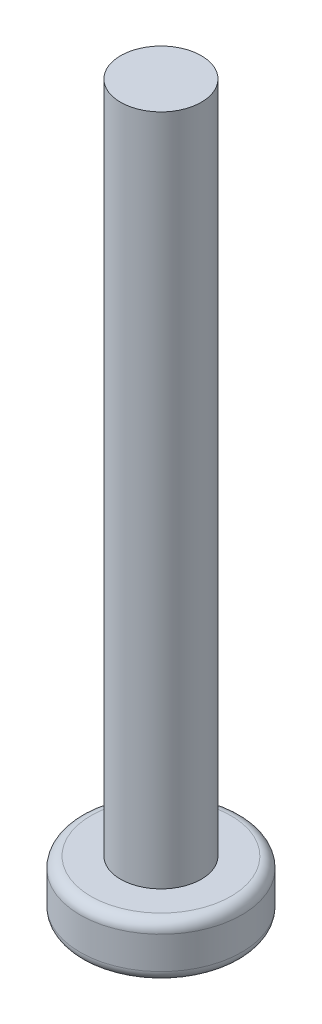
ISO-10303-21;
HEADER;
FILE_DESCRIPTION(('STEP AP214'),'2;1');
FILE_NAME('part.step','',(''),(''),'','','');
FILE_SCHEMA(('AUTOMOTIVE_DESIGN { 1 0 10303 214 1 1 1 1 }'));
ENDSEC;
DATA;
#1=APPLICATION_CONTEXT('core data for automotive mechanical design processes');
#2=APPLICATION_PROTOCOL_DEFINITION('international standard','automotive_design',2000,#1);
#3=PRODUCT_CONTEXT('',#1,'mechanical');
#4=PRODUCT('Part','Part','',(#3));
#5=PRODUCT_RELATED_PRODUCT_CATEGORY('part','',(#4));
#6=PRODUCT_DEFINITION_FORMATION('','',#4);
#7=PRODUCT_DEFINITION_CONTEXT('part definition',#1,'design');
#8=PRODUCT_DEFINITION('design','',#6,#7);
#9=PRODUCT_DEFINITION_SHAPE('','',#8);
#10=(LENGTH_UNIT() NAMED_UNIT(*) SI_UNIT(.MILLI.,.METRE.));
#11=(NAMED_UNIT(*) PLANE_ANGLE_UNIT() SI_UNIT($,.RADIAN.));
#12=(NAMED_UNIT(*) SI_UNIT($,.STERADIAN.) SOLID_ANGLE_UNIT());
#13=UNCERTAINTY_MEASURE_WITH_UNIT(LENGTH_MEASURE(1.E-05),#10,'distance_accuracy_value','');
#14=(GEOMETRIC_REPRESENTATION_CONTEXT(3) GLOBAL_UNCERTAINTY_ASSIGNED_CONTEXT((#13)) GLOBAL_UNIT_ASSIGNED_CONTEXT((#10,
#11,#12)) REPRESENTATION_CONTEXT('',''));
#15=CARTESIAN_POINT('',(0.,0.,0.));
#16=DIRECTION('',(0.,0.,1.));
#17=DIRECTION('',(1.,0.,0.));
#18=AXIS2_PLACEMENT_3D('',#15,#16,#17);
#19=CARTESIAN_POINT('',(0.,2.,0.));
#20=DIRECTION('',(0.,1.,0.));
#21=DIRECTION('',(0.,0.,1.));
#22=AXIS2_PLACEMENT_3D('',#19,#20,#21);
#23=PLANE('',#22);
#24=CARTESIAN_POINT('',(0.,2.,0.));
#25=DIRECTION('',(0.,1.,0.));
#26=DIRECTION('',(0.,0.,1.));
#27=AXIS2_PLACEMENT_3D('',#24,#25,#26);
#28=CIRCLE('',#27,2.6);
#29=CARTESIAN_POINT('',(0.,2.,2.6));
#30=VERTEX_POINT('',#29);
#31=EDGE_CURVE('E215',#30,#30,#28,.T.);
#32=ORIENTED_EDGE('',*,*,#31,.T.);
#33=EDGE_LOOP('',(#32));
#34=FACE_BOUND('',#33,.T.);
#35=CARTESIAN_POINT('',(0.,2.,0.));
#36=DIRECTION('',(0.,1.,0.));
#37=DIRECTION('',(0.,0.,1.));
#38=AXIS2_PLACEMENT_3D('',#35,#36,#37);
#39=CIRCLE('',#38,1.5);
#40=CARTESIAN_POINT('',(0.,2.,1.5));
#41=VERTEX_POINT('',#40);
#42=EDGE_CURVE('E194',#41,#41,#39,.T.);
#43=ORIENTED_EDGE('',*,*,#42,.F.);
#44=EDGE_LOOP('',(#43));
#45=FACE_BOUND('',#44,.T.);
#46=ADVANCED_FACE('F35',(#34,#45),#23,.T.);
#47=CARTESIAN_POINT('',(0.,2.,0.));
#48=DIRECTION('',(0.,-1.,0.));
#49=DIRECTION('',(0.,0.,-1.));
#50=AXIS2_PLACEMENT_3D('',#47,#48,#49);
#51=CYLINDRICAL_SURFACE('',#50,3.);
#52=CARTESIAN_POINT('',(0.,1.6,0.));
#53=DIRECTION('',(0.,1.,0.));
#54=DIRECTION('',(0.,0.,1.));
#55=AXIS2_PLACEMENT_3D('',#52,#53,#54);
#56=CIRCLE('',#55,3.);
#57=CARTESIAN_POINT('',(0.,1.6,3.));
#58=VERTEX_POINT('',#57);
#59=EDGE_CURVE('E43',#58,#58,#56,.F.);
#60=ORIENTED_EDGE('',*,*,#59,.T.);
#61=EDGE_LOOP('',(#60));
#62=FACE_BOUND('',#61,.T.);
#63=CARTESIAN_POINT('',(0.,0.4,0.));
#64=DIRECTION('',(0.,1.,0.));
#65=DIRECTION('',(0.,0.,1.));
#66=AXIS2_PLACEMENT_3D('',#63,#64,#65);
#67=CIRCLE('',#66,3.);
#68=CARTESIAN_POINT('',(0.,0.4,3.));
#69=VERTEX_POINT('',#68);
#70=EDGE_CURVE('E220',#69,#69,#67,.T.);
#71=ORIENTED_EDGE('',*,*,#70,.T.);
#72=EDGE_LOOP('',(#71));
#73=FACE_BOUND('',#72,.T.);
#74=ADVANCED_FACE('F225',(#62,#73),#51,.T.);
#75=CARTESIAN_POINT('',(0.,0.,0.));
#76=DIRECTION('',(0.,1.,0.));
#77=DIRECTION('',(0.,0.,1.));
#78=AXIS2_PLACEMENT_3D('',#75,#76,#77);
#79=PLANE('',#78);
#80=CARTESIAN_POINT('',(0.,0.,0.));
#81=DIRECTION('',(0.,1.,0.));
#82=DIRECTION('',(0.,0.,1.));
#83=AXIS2_PLACEMENT_3D('',#80,#81,#82);
#84=CIRCLE('',#83,2.6);
#85=CARTESIAN_POINT('',(0.,0.,2.6));
#86=VERTEX_POINT('',#85);
#87=EDGE_CURVE('E11',#86,#86,#84,.F.);
#88=ORIENTED_EDGE('',*,*,#87,.T.);
#89=EDGE_LOOP('',(#88));
#90=FACE_BOUND('',#89,.T.);
#91=DIRECTION('',(1.,0.,0.));
#92=VECTOR('',#91,1.);
#93=CARTESIAN_POINT('',(0.,0.,0.45));
#94=LINE('',#93,#92);
#95=CARTESIAN_POINT('',(-1.5,0.,0.45));
#96=VERTEX_POINT('',#95);
#97=CARTESIAN_POINT('',(-0.45,0.,0.45));
#98=VERTEX_POINT('',#97);
#99=EDGE_CURVE('E162',#96,#98,#94,.T.);
#100=ORIENTED_EDGE('',*,*,#99,.T.);
#101=DIRECTION('',(0.,0.,-1.));
#102=VECTOR('',#101,1.);
#103=CARTESIAN_POINT('',(-0.45,0.,0.));
#104=LINE('',#103,#102);
#105=CARTESIAN_POINT('',(-0.45,0.,1.5));
#106=VERTEX_POINT('',#105);
#107=EDGE_CURVE('E50',#106,#98,#104,.T.);
#108=ORIENTED_EDGE('',*,*,#107,.F.);
#109=DIRECTION('',(1.,0.,0.));
#110=VECTOR('',#109,1.);
#111=CARTESIAN_POINT('',(0.,0.,1.5));
#112=LINE('',#111,#110);
#113=CARTESIAN_POINT('',(0.45,0.,1.5));
#114=VERTEX_POINT('',#113);
#115=EDGE_CURVE('E189',#106,#114,#112,.T.);
#116=ORIENTED_EDGE('',*,*,#115,.T.);
#117=DIRECTION('',(0.,0.,-1.));
#118=VECTOR('',#117,1.);
#119=CARTESIAN_POINT('',(0.45,0.,0.));
#120=LINE('',#119,#118);
#121=CARTESIAN_POINT('',(0.45,0.,0.45));
#122=VERTEX_POINT('',#121);
#123=EDGE_CURVE('E187',#114,#122,#120,.T.);
#124=ORIENTED_EDGE('',*,*,#123,.T.);
#125=DIRECTION('',(1.,0.,0.));
#126=VECTOR('',#125,1.);
#127=CARTESIAN_POINT('',(0.,0.,0.45));
#128=LINE('',#127,#126);
#129=CARTESIAN_POINT('',(1.5,0.,0.45));
#130=VERTEX_POINT('',#129);
#131=EDGE_CURVE('E145',#122,#130,#128,.T.);
#132=ORIENTED_EDGE('',*,*,#131,.T.);
#133=DIRECTION('',(0.,0.,-1.));
#134=VECTOR('',#133,1.);
#135=CARTESIAN_POINT('',(1.5,0.,0.));
#136=LINE('',#135,#134);
#137=CARTESIAN_POINT('',(1.5,0.,-0.45));
#138=VERTEX_POINT('',#137);
#139=EDGE_CURVE('E183',#130,#138,#136,.T.);
#140=ORIENTED_EDGE('',*,*,#139,.T.);
#141=DIRECTION('',(1.,0.,0.));
#142=VECTOR('',#141,1.);
#143=CARTESIAN_POINT('',(0.,0.,-0.45));
#144=LINE('',#143,#142);
#145=CARTESIAN_POINT('',(0.45,0.,-0.45));
#146=VERTEX_POINT('',#145);
#147=EDGE_CURVE('E180',#146,#138,#144,.T.);
#148=ORIENTED_EDGE('',*,*,#147,.F.);
#149=DIRECTION('',(0.,0.,-1.));
#150=VECTOR('',#149,1.);
#151=CARTESIAN_POINT('',(0.45,0.,0.));
#152=LINE('',#151,#150);
#153=CARTESIAN_POINT('',(0.45,0.,-1.5));
#154=VERTEX_POINT('',#153);
#155=EDGE_CURVE('E177',#146,#154,#152,.T.);
#156=ORIENTED_EDGE('',*,*,#155,.T.);
#157=DIRECTION('',(1.,0.,0.));
#158=VECTOR('',#157,1.);
#159=CARTESIAN_POINT('',(0.,0.,-1.5));
#160=LINE('',#159,#158);
#161=CARTESIAN_POINT('',(-0.45,0.,-1.5));
#162=VERTEX_POINT('',#161);
#163=EDGE_CURVE('E174',#162,#154,#160,.T.);
#164=ORIENTED_EDGE('',*,*,#163,.F.);
#165=DIRECTION('',(0.,0.,-1.));
#166=VECTOR('',#165,1.);
#167=CARTESIAN_POINT('',(-0.45,0.,0.));
#168=LINE('',#167,#166);
#169=CARTESIAN_POINT('',(-0.45,0.,-0.45));
#170=VERTEX_POINT('',#169);
#171=EDGE_CURVE('E171',#170,#162,#168,.T.);
#172=ORIENTED_EDGE('',*,*,#171,.F.);
#173=DIRECTION('',(1.,0.,0.));
#174=VECTOR('',#173,1.);
#175=CARTESIAN_POINT('',(0.,0.,-0.45));
#176=LINE('',#175,#174);
#177=CARTESIAN_POINT('',(-1.5,0.,-0.45));
#178=VERTEX_POINT('',#177);
#179=EDGE_CURVE('E168',#178,#170,#176,.T.);
#180=ORIENTED_EDGE('',*,*,#179,.F.);
#181=DIRECTION('',(0.,0.,-1.));
#182=VECTOR('',#181,1.);
#183=CARTESIAN_POINT('',(-1.5,0.,0.));
#184=LINE('',#183,#182);
#185=EDGE_CURVE('E165',#96,#178,#184,.T.);
#186=ORIENTED_EDGE('',*,*,#185,.F.);
#187=EDGE_LOOP('',(#100,#108,#116,#124,#132,#140,#148,#156,#164,#172,#180,#186));
#188=FACE_BOUND('',#187,.T.);
#189=ADVANCED_FACE('F241',(#90,#188),#79,.F.);
#190=CARTESIAN_POINT('',(0.,27.,0.));
#191=DIRECTION('',(0.,-1.,0.));
#192=DIRECTION('',(0.,0.,-1.));
#193=AXIS2_PLACEMENT_3D('',#190,#191,#192);
#194=CYLINDRICAL_SURFACE('',#193,1.5);
#195=CARTESIAN_POINT('',(0.,27.,0.));
#196=DIRECTION('',(0.,1.,0.));
#197=DIRECTION('',(0.,0.,1.));
#198=AXIS2_PLACEMENT_3D('',#195,#196,#197);
#199=CIRCLE('',#198,1.5);
#200=CARTESIAN_POINT('',(0.,27.,1.5));
#201=VERTEX_POINT('',#200);
#202=EDGE_CURVE('E212',#201,#201,#199,.T.);
#203=ORIENTED_EDGE('',*,*,#202,.F.);
#204=EDGE_LOOP('',(#203));
#205=FACE_BOUND('',#204,.T.);
#206=ORIENTED_EDGE('',*,*,#42,.T.);
#207=EDGE_LOOP('',(#206));
#208=FACE_BOUND('',#207,.T.);
#209=ADVANCED_FACE('F238',(#205,#208),#194,.T.);
#210=CARTESIAN_POINT('',(0.,27.,0.));
#211=DIRECTION('',(0.,1.,0.));
#212=DIRECTION('',(0.,0.,1.));
#213=AXIS2_PLACEMENT_3D('',#210,#211,#212);
#214=PLANE('',#213);
#215=ORIENTED_EDGE('',*,*,#202,.T.);
#216=EDGE_LOOP('',(#215));
#217=FACE_BOUND('',#216,.T.);
#218=ADVANCED_FACE('F240',(#217),#214,.T.);
#219=CARTESIAN_POINT('',(-0.45,1.9,0.));
#220=DIRECTION('',(-1.,0.,0.));
#221=DIRECTION('',(0.,0.,1.));
#222=AXIS2_PLACEMENT_3D('',#219,#220,#221);
#223=PLANE('',#222);
#224=ORIENTED_EDGE('',*,*,#107,.T.);
#225=DIRECTION('',(0.,-1.,0.));
#226=VECTOR('',#225,1.);
#227=CARTESIAN_POINT('',(-0.45,1.9,0.45));
#228=LINE('',#227,#226);
#229=CARTESIAN_POINT('',(-0.45,1.9,0.45));
#230=VERTEX_POINT('',#229);
#231=EDGE_CURVE('E160',#230,#98,#228,.T.);
#232=ORIENTED_EDGE('',*,*,#231,.F.);
#233=DIRECTION('',(0.,0.,-1.));
#234=VECTOR('',#233,1.);
#235=CARTESIAN_POINT('',(-0.45,1.9,0.));
#236=LINE('',#235,#234);
#237=CARTESIAN_POINT('',(-0.45,1.9,1.5));
#238=VERTEX_POINT('',#237);
#239=EDGE_CURVE('E192',#238,#230,#236,.T.);
#240=ORIENTED_EDGE('',*,*,#239,.F.);
#241=DIRECTION('',(0.,-1.,0.));
#242=VECTOR('',#241,1.);
#243=CARTESIAN_POINT('',(-0.45,1.9,1.5));
#244=LINE('',#243,#242);
#245=EDGE_CURVE('E58',#238,#106,#244,.T.);
#246=ORIENTED_EDGE('',*,*,#245,.T.);
#247=EDGE_LOOP('',(#224,#232,#240,#246));
#248=FACE_BOUND('',#247,.T.);
#249=ADVANCED_FACE('F248',(#248),#223,.F.);
#250=CARTESIAN_POINT('',(0.,1.9,1.5));
#251=DIRECTION('',(0.,0.,-1.));
#252=DIRECTION('',(-1.,0.,0.));
#253=AXIS2_PLACEMENT_3D('',#250,#251,#252);
#254=PLANE('',#253);
#255=ORIENTED_EDGE('',*,*,#115,.F.);
#256=ORIENTED_EDGE('',*,*,#245,.F.);
#257=DIRECTION('',(1.,0.,0.));
#258=VECTOR('',#257,1.);
#259=CARTESIAN_POINT('',(0.,1.9,1.5));
#260=LINE('',#259,#258);
#261=CARTESIAN_POINT('',(0.45,1.9,1.5));
#262=VERTEX_POINT('',#261);
#263=EDGE_CURVE('E138',#238,#262,#260,.T.);
#264=ORIENTED_EDGE('',*,*,#263,.T.);
#265=DIRECTION('',(0.,-1.,0.));
#266=VECTOR('',#265,1.);
#267=CARTESIAN_POINT('',(0.45,1.9,1.5));
#268=LINE('',#267,#266);
#269=EDGE_CURVE('E135',#262,#114,#268,.T.);
#270=ORIENTED_EDGE('',*,*,#269,.T.);
#271=EDGE_LOOP('',(#255,#256,#264,#270));
#272=FACE_BOUND('',#271,.T.);
#273=ADVANCED_FACE('F321',(#272),#254,.T.);
#274=CARTESIAN_POINT('',(0.45,1.9,0.));
#275=DIRECTION('',(-1.,0.,0.));
#276=DIRECTION('',(0.,0.,1.));
#277=AXIS2_PLACEMENT_3D('',#274,#275,#276);
#278=PLANE('',#277);
#279=ORIENTED_EDGE('',*,*,#123,.F.);
#280=ORIENTED_EDGE('',*,*,#269,.F.);
#281=DIRECTION('',(0.,0.,-1.));
#282=VECTOR('',#281,1.);
#283=CARTESIAN_POINT('',(0.45,1.9,0.));
#284=LINE('',#283,#282);
#285=CARTESIAN_POINT('',(0.45,1.9,0.45));
#286=VERTEX_POINT('',#285);
#287=EDGE_CURVE('E129',#262,#286,#284,.T.);
#288=ORIENTED_EDGE('',*,*,#287,.T.);
#289=DIRECTION('',(0.,-1.,0.));
#290=VECTOR('',#289,1.);
#291=CARTESIAN_POINT('',(0.45,1.9,0.45));
#292=LINE('',#291,#290);
#293=EDGE_CURVE('E133',#286,#122,#292,.T.);
#294=ORIENTED_EDGE('',*,*,#293,.T.);
#295=EDGE_LOOP('',(#279,#280,#288,#294));
#296=FACE_BOUND('',#295,.T.);
#297=ADVANCED_FACE('F132',(#296),#278,.T.);
#298=CARTESIAN_POINT('',(0.,1.9,0.45));
#299=DIRECTION('',(0.,0.,-1.));
#300=DIRECTION('',(-1.,0.,0.));
#301=AXIS2_PLACEMENT_3D('',#298,#299,#300);
#302=PLANE('',#301);
#303=ORIENTED_EDGE('',*,*,#131,.F.);
#304=ORIENTED_EDGE('',*,*,#293,.F.);
#305=DIRECTION('',(1.,0.,0.));
#306=VECTOR('',#305,1.);
#307=CARTESIAN_POINT('',(0.,1.9,0.45));
#308=LINE('',#307,#306);
#309=CARTESIAN_POINT('',(1.5,1.9,0.45));
#310=VERTEX_POINT('',#309);
#311=EDGE_CURVE('E139',#286,#310,#308,.T.);
#312=ORIENTED_EDGE('',*,*,#311,.T.);
#313=DIRECTION('',(0.,-1.,0.));
#314=VECTOR('',#313,1.);
#315=CARTESIAN_POINT('',(1.5,1.9,0.45));
#316=LINE('',#315,#314);
#317=EDGE_CURVE('E147',#310,#130,#316,.T.);
#318=ORIENTED_EDGE('',*,*,#317,.T.);
#319=EDGE_LOOP('',(#303,#304,#312,#318));
#320=FACE_BOUND('',#319,.T.);
#321=ADVANCED_FACE('F142',(#320),#302,.T.);
#322=CARTESIAN_POINT('',(1.5,1.9,0.));
#323=DIRECTION('',(-1.,0.,0.));
#324=DIRECTION('',(0.,0.,1.));
#325=AXIS2_PLACEMENT_3D('',#322,#323,#324);
#326=PLANE('',#325);
#327=ORIENTED_EDGE('',*,*,#139,.F.);
#328=ORIENTED_EDGE('',*,*,#317,.F.);
#329=DIRECTION('',(0.,0.,-1.));
#330=VECTOR('',#329,1.);
#331=CARTESIAN_POINT('',(1.5,1.9,0.));
#332=LINE('',#331,#330);
#333=CARTESIAN_POINT('',(1.5,1.9,-0.45));
#334=VERTEX_POINT('',#333);
#335=EDGE_CURVE('E153',#310,#334,#332,.T.);
#336=ORIENTED_EDGE('',*,*,#335,.T.);
#337=DIRECTION('',(0.,-1.,0.));
#338=VECTOR('',#337,1.);
#339=CARTESIAN_POINT('',(1.5,1.9,-0.45));
#340=LINE('',#339,#338);
#341=EDGE_CURVE('E197',#334,#138,#340,.T.);
#342=ORIENTED_EDGE('',*,*,#341,.T.);
#343=EDGE_LOOP('',(#327,#328,#336,#342));
#344=FACE_BOUND('',#343,.T.);
#345=ADVANCED_FACE('F320',(#344),#326,.T.);
#346=CARTESIAN_POINT('',(0.,1.9,-0.45));
#347=DIRECTION('',(0.,0.,-1.));
#348=DIRECTION('',(-1.,0.,0.));
#349=AXIS2_PLACEMENT_3D('',#346,#347,#348);
#350=PLANE('',#349);
#351=ORIENTED_EDGE('',*,*,#147,.T.);
#352=ORIENTED_EDGE('',*,*,#341,.F.);
#353=DIRECTION('',(1.,0.,0.));
#354=VECTOR('',#353,1.);
#355=CARTESIAN_POINT('',(0.,1.9,-0.45));
#356=LINE('',#355,#354);
#357=CARTESIAN_POINT('',(0.45,1.9,-0.45));
#358=VERTEX_POINT('',#357);
#359=EDGE_CURVE('E155',#358,#334,#356,.T.);
#360=ORIENTED_EDGE('',*,*,#359,.F.);
#361=DIRECTION('',(0.,-1.,0.));
#362=VECTOR('',#361,1.);
#363=CARTESIAN_POINT('',(0.45,1.9,-0.45));
#364=LINE('',#363,#362);
#365=EDGE_CURVE('E199',#358,#146,#364,.T.);
#366=ORIENTED_EDGE('',*,*,#365,.T.);
#367=EDGE_LOOP('',(#351,#352,#360,#366));
#368=FACE_BOUND('',#367,.T.);
#369=ADVANCED_FACE('F315',(#368),#350,.F.);
#370=CARTESIAN_POINT('',(0.45,1.9,0.));
#371=DIRECTION('',(-1.,0.,0.));
#372=DIRECTION('',(0.,0.,1.));
#373=AXIS2_PLACEMENT_3D('',#370,#371,#372);
#374=PLANE('',#373);
#375=ORIENTED_EDGE('',*,*,#155,.F.);
#376=ORIENTED_EDGE('',*,*,#365,.F.);
#377=DIRECTION('',(0.,0.,-1.));
#378=VECTOR('',#377,1.);
#379=CARTESIAN_POINT('',(0.45,1.9,0.));
#380=LINE('',#379,#378);
#381=CARTESIAN_POINT('',(0.45,1.9,-1.5));
#382=VERTEX_POINT('',#381);
#383=EDGE_CURVE('E310',#358,#382,#380,.T.);
#384=ORIENTED_EDGE('',*,*,#383,.T.);
#385=DIRECTION('',(0.,-1.,0.));
#386=VECTOR('',#385,1.);
#387=CARTESIAN_POINT('',(0.45,1.9,-1.5));
#388=LINE('',#387,#386);
#389=EDGE_CURVE('E201',#382,#154,#388,.T.);
#390=ORIENTED_EDGE('',*,*,#389,.T.);
#391=EDGE_LOOP('',(#375,#376,#384,#390));
#392=FACE_BOUND('',#391,.T.);
#393=ADVANCED_FACE('F337',(#392),#374,.T.);
#394=CARTESIAN_POINT('',(0.,1.9,-1.5));
#395=DIRECTION('',(0.,0.,-1.));
#396=DIRECTION('',(-1.,0.,0.));
#397=AXIS2_PLACEMENT_3D('',#394,#395,#396);
#398=PLANE('',#397);
#399=ORIENTED_EDGE('',*,*,#163,.T.);
#400=ORIENTED_EDGE('',*,*,#389,.F.);
#401=DIRECTION('',(1.,0.,0.));
#402=VECTOR('',#401,1.);
#403=CARTESIAN_POINT('',(0.,1.9,-1.5));
#404=LINE('',#403,#402);
#405=CARTESIAN_POINT('',(-0.45,1.9,-1.5));
#406=VERTEX_POINT('',#405);
#407=EDGE_CURVE('E307',#406,#382,#404,.T.);
#408=ORIENTED_EDGE('',*,*,#407,.F.);
#409=DIRECTION('',(0.,-1.,0.));
#410=VECTOR('',#409,1.);
#411=CARTESIAN_POINT('',(-0.45,1.9,-1.5));
#412=LINE('',#411,#410);
#413=EDGE_CURVE('E203',#406,#162,#412,.T.);
#414=ORIENTED_EDGE('',*,*,#413,.T.);
#415=EDGE_LOOP('',(#399,#400,#408,#414));
#416=FACE_BOUND('',#415,.T.);
#417=ADVANCED_FACE('F340',(#416),#398,.F.);
#418=CARTESIAN_POINT('',(-0.45,1.9,0.));
#419=DIRECTION('',(-1.,0.,0.));
#420=DIRECTION('',(0.,0.,1.));
#421=AXIS2_PLACEMENT_3D('',#418,#419,#420);
#422=PLANE('',#421);
#423=ORIENTED_EDGE('',*,*,#171,.T.);
#424=ORIENTED_EDGE('',*,*,#413,.F.);
#425=DIRECTION('',(0.,0.,-1.));
#426=VECTOR('',#425,1.);
#427=CARTESIAN_POINT('',(-0.45,1.9,0.));
#428=LINE('',#427,#426);
#429=CARTESIAN_POINT('',(-0.45,1.9,-0.45));
#430=VERTEX_POINT('',#429);
#431=EDGE_CURVE('E304',#430,#406,#428,.T.);
#432=ORIENTED_EDGE('',*,*,#431,.F.);
#433=DIRECTION('',(0.,-1.,0.));
#434=VECTOR('',#433,1.);
#435=CARTESIAN_POINT('',(-0.45,1.9,-0.45));
#436=LINE('',#435,#434);
#437=EDGE_CURVE('E205',#430,#170,#436,.T.);
#438=ORIENTED_EDGE('',*,*,#437,.T.);
#439=EDGE_LOOP('',(#423,#424,#432,#438));
#440=FACE_BOUND('',#439,.T.);
#441=ADVANCED_FACE('F344',(#440),#422,.F.);
#442=CARTESIAN_POINT('',(0.,1.9,-0.45));
#443=DIRECTION('',(0.,0.,-1.));
#444=DIRECTION('',(-1.,0.,0.));
#445=AXIS2_PLACEMENT_3D('',#442,#443,#444);
#446=PLANE('',#445);
#447=ORIENTED_EDGE('',*,*,#179,.T.);
#448=ORIENTED_EDGE('',*,*,#437,.F.);
#449=DIRECTION('',(1.,0.,0.));
#450=VECTOR('',#449,1.);
#451=CARTESIAN_POINT('',(0.,1.9,-0.45));
#452=LINE('',#451,#450);
#453=CARTESIAN_POINT('',(-1.5,1.9,-0.45));
#454=VERTEX_POINT('',#453);
#455=EDGE_CURVE('E301',#454,#430,#452,.T.);
#456=ORIENTED_EDGE('',*,*,#455,.F.);
#457=DIRECTION('',(0.,-1.,0.));
#458=VECTOR('',#457,1.);
#459=CARTESIAN_POINT('',(-1.5,1.9,-0.45));
#460=LINE('',#459,#458);
#461=EDGE_CURVE('E207',#454,#178,#460,.T.);
#462=ORIENTED_EDGE('',*,*,#461,.T.);
#463=EDGE_LOOP('',(#447,#448,#456,#462));
#464=FACE_BOUND('',#463,.T.);
#465=ADVANCED_FACE('F348',(#464),#446,.F.);
#466=CARTESIAN_POINT('',(-1.5,1.9,0.));
#467=DIRECTION('',(-1.,0.,0.));
#468=DIRECTION('',(0.,0.,1.));
#469=AXIS2_PLACEMENT_3D('',#466,#467,#468);
#470=PLANE('',#469);
#471=ORIENTED_EDGE('',*,*,#185,.T.);
#472=ORIENTED_EDGE('',*,*,#461,.F.);
#473=DIRECTION('',(0.,0.,-1.));
#474=VECTOR('',#473,1.);
#475=CARTESIAN_POINT('',(-1.5,1.9,0.));
#476=LINE('',#475,#474);
#477=CARTESIAN_POINT('',(-1.5,1.9,0.45));
#478=VERTEX_POINT('',#477);
#479=EDGE_CURVE('E297',#478,#454,#476,.T.);
#480=ORIENTED_EDGE('',*,*,#479,.F.);
#481=DIRECTION('',(0.,-1.,0.));
#482=VECTOR('',#481,1.);
#483=CARTESIAN_POINT('',(-1.5,1.9,0.45));
#484=LINE('',#483,#482);
#485=EDGE_CURVE('E209',#478,#96,#484,.T.);
#486=ORIENTED_EDGE('',*,*,#485,.T.);
#487=EDGE_LOOP('',(#471,#472,#480,#486));
#488=FACE_BOUND('',#487,.T.);
#489=ADVANCED_FACE('F352',(#488),#470,.F.);
#490=CARTESIAN_POINT('',(0.,1.9,0.45));
#491=DIRECTION('',(0.,0.,-1.));
#492=DIRECTION('',(-1.,0.,0.));
#493=AXIS2_PLACEMENT_3D('',#490,#491,#492);
#494=PLANE('',#493);
#495=ORIENTED_EDGE('',*,*,#99,.F.);
#496=ORIENTED_EDGE('',*,*,#485,.F.);
#497=DIRECTION('',(1.,0.,0.));
#498=VECTOR('',#497,1.);
#499=CARTESIAN_POINT('',(0.,1.9,0.45));
#500=LINE('',#499,#498);
#501=EDGE_CURVE('E102',#478,#230,#500,.T.);
#502=ORIENTED_EDGE('',*,*,#501,.T.);
#503=ORIENTED_EDGE('',*,*,#231,.T.);
#504=EDGE_LOOP('',(#495,#496,#502,#503));
#505=FACE_BOUND('',#504,.T.);
#506=ADVANCED_FACE('F293',(#505),#494,.T.);
#507=CARTESIAN_POINT('',(0.,1.9,0.));
#508=DIRECTION('',(0.,-1.,0.));
#509=DIRECTION('',(0.,0.,-1.));
#510=AXIS2_PLACEMENT_3D('',#507,#508,#509);
#511=PLANE('',#510);
#512=ORIENTED_EDGE('',*,*,#239,.T.);
#513=ORIENTED_EDGE('',*,*,#501,.F.);
#514=ORIENTED_EDGE('',*,*,#479,.T.);
#515=ORIENTED_EDGE('',*,*,#455,.T.);
#516=ORIENTED_EDGE('',*,*,#431,.T.);
#517=ORIENTED_EDGE('',*,*,#407,.T.);
#518=ORIENTED_EDGE('',*,*,#383,.F.);
#519=ORIENTED_EDGE('',*,*,#359,.T.);
#520=ORIENTED_EDGE('',*,*,#335,.F.);
#521=ORIENTED_EDGE('',*,*,#311,.F.);
#522=ORIENTED_EDGE('',*,*,#287,.F.);
#523=ORIENTED_EDGE('',*,*,#263,.F.);
#524=EDGE_LOOP('',(#512,#513,#514,#515,#516,#517,#518,#519,#520,#521,#522,#523));
#525=FACE_BOUND('',#524,.T.);
#526=ADVANCED_FACE('F151',(#525),#511,.T.);
#527=CARTESIAN_POINT('',(0.,1.6,0.));
#528=DIRECTION('',(0.,1.,0.));
#529=DIRECTION('',(0.,0.,1.));
#530=AXIS2_PLACEMENT_3D('',#527,#528,#529);
#531=TOROIDAL_SURFACE('',#530,2.6,0.4);
#532=ORIENTED_EDGE('',*,*,#59,.F.);
#533=EDGE_LOOP('',(#532));
#534=FACE_BOUND('',#533,.T.);
#535=ORIENTED_EDGE('',*,*,#31,.F.);
#536=EDGE_LOOP('',(#535));
#537=FACE_BOUND('',#536,.T.);
#538=ADVANCED_FACE('F228',(#534,#537),#531,.T.);
#539=CARTESIAN_POINT('',(0.,0.4,0.));
#540=DIRECTION('',(0.,1.,0.));
#541=DIRECTION('',(0.,0.,1.));
#542=AXIS2_PLACEMENT_3D('',#539,#540,#541);
#543=TOROIDAL_SURFACE('',#542,2.6,0.4);
#544=ORIENTED_EDGE('',*,*,#87,.F.);
#545=EDGE_LOOP('',(#544));
#546=FACE_BOUND('',#545,.T.);
#547=ORIENTED_EDGE('',*,*,#70,.F.);
#548=EDGE_LOOP('',(#547));
#549=FACE_BOUND('',#548,.T.);
#550=ADVANCED_FACE('F37',(#546,#549),#543,.T.);
#551=CLOSED_SHELL('',(#46,#74,#189,#209,#218,#249,#273,#297,#321,#345,#369,#393,#417,#441,#465,
#489,#506,#526,#538,#550));
#552=MANIFOLD_SOLID_BREP('B2',#551);
#553=ADVANCED_BREP_SHAPE_REPRESENTATION('',(#18,#552),#14);
#554=SHAPE_DEFINITION_REPRESENTATION(#9,#553);
ENDSEC;
END-ISO-10303-21;
